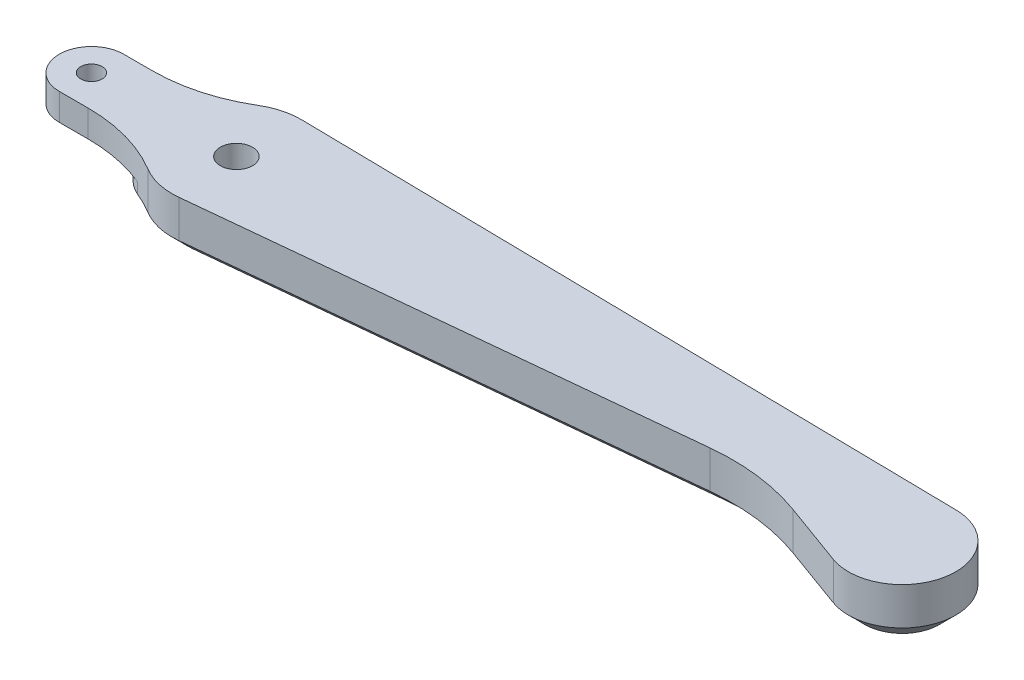
ISO-10303-21;
HEADER;
FILE_DESCRIPTION(('STEP AP214'),'2;1');
FILE_NAME('part.step','',(''),(''),'','','');
FILE_SCHEMA(('AUTOMOTIVE_DESIGN { 1 0 10303 214 1 1 1 1 }'));
ENDSEC;
DATA;
#1=APPLICATION_CONTEXT('core data for automotive mechanical design processes');
#2=APPLICATION_PROTOCOL_DEFINITION('international standard','automotive_design',2000,#1);
#3=PRODUCT_CONTEXT('',#1,'mechanical');
#4=PRODUCT('Part','Part','',(#3));
#5=PRODUCT_RELATED_PRODUCT_CATEGORY('part','',(#4));
#6=PRODUCT_DEFINITION_FORMATION('','',#4);
#7=PRODUCT_DEFINITION_CONTEXT('part definition',#1,'design');
#8=PRODUCT_DEFINITION('design','',#6,#7);
#9=PRODUCT_DEFINITION_SHAPE('','',#8);
#10=(LENGTH_UNIT() NAMED_UNIT(*) SI_UNIT(.MILLI.,.METRE.));
#11=(NAMED_UNIT(*) PLANE_ANGLE_UNIT() SI_UNIT($,.RADIAN.));
#12=(NAMED_UNIT(*) SI_UNIT($,.STERADIAN.) SOLID_ANGLE_UNIT());
#13=UNCERTAINTY_MEASURE_WITH_UNIT(LENGTH_MEASURE(1.E-05),#10,'distance_accuracy_value','');
#14=(GEOMETRIC_REPRESENTATION_CONTEXT(3) GLOBAL_UNCERTAINTY_ASSIGNED_CONTEXT((#13)) GLOBAL_UNIT_ASSIGNED_CONTEXT((#10,
#11,#12)) REPRESENTATION_CONTEXT('',''));
#15=CARTESIAN_POINT('',(0.,0.,0.));
#16=DIRECTION('',(0.,0.,1.));
#17=DIRECTION('',(1.,0.,0.));
#18=AXIS2_PLACEMENT_3D('',#15,#16,#17);
#19=CARTESIAN_POINT('',(-13.5,5.,0.));
#20=DIRECTION('',(0.,-1.,0.));
#21=DIRECTION('',(0.,0.,-1.));
#22=AXIS2_PLACEMENT_3D('',#19,#20,#21);
#23=CYLINDRICAL_SURFACE('',#22,3.);
#24=CARTESIAN_POINT('',(-13.5,2.5,0.));
#25=DIRECTION('',(0.,-1.,0.));
#26=DIRECTION('',(0.,0.,-1.));
#27=AXIS2_PLACEMENT_3D('',#24,#25,#26);
#28=CIRCLE('',#27,3.);
#29=CARTESIAN_POINT('',(-13.5,2.5,3.));
#30=VERTEX_POINT('',#29);
#31=CARTESIAN_POINT('',(-13.5,2.5,-3.));
#32=VERTEX_POINT('',#31);
#33=EDGE_CURVE('E193',#30,#32,#28,.T.);
#34=ORIENTED_EDGE('',*,*,#33,.F.);
#35=DIRECTION('',(0.,-1.,0.));
#36=VECTOR('',#35,1.);
#37=CARTESIAN_POINT('',(-13.5,5.,3.));
#38=LINE('',#37,#36);
#39=CARTESIAN_POINT('',(-13.5,5.,3.));
#40=VERTEX_POINT('',#39);
#41=EDGE_CURVE('E218',#40,#30,#38,.T.);
#42=ORIENTED_EDGE('',*,*,#41,.F.);
#43=CARTESIAN_POINT('',(-13.5,5.,0.));
#44=DIRECTION('',(0.,1.,0.));
#45=DIRECTION('',(0.,0.,1.));
#46=AXIS2_PLACEMENT_3D('',#43,#44,#45);
#47=CIRCLE('',#46,3.);
#48=CARTESIAN_POINT('',(-13.5,5.,-3.));
#49=VERTEX_POINT('',#48);
#50=EDGE_CURVE('E216',#49,#40,#47,.T.);
#51=ORIENTED_EDGE('',*,*,#50,.F.);
#52=DIRECTION('',(0.,-1.,0.));
#53=VECTOR('',#52,1.);
#54=CARTESIAN_POINT('',(-13.5,5.,-3.));
#55=LINE('',#54,#53);
#56=EDGE_CURVE('E210',#49,#32,#55,.T.);
#57=ORIENTED_EDGE('',*,*,#56,.T.);
#58=EDGE_LOOP('',(#34,#42,#51,#57));
#59=FACE_BOUND('',#58,.T.);
#60=ADVANCED_FACE('F41',(#59),#23,.T.);
#61=CARTESIAN_POINT('',(-13.5,5.,0.));
#62=DIRECTION('',(0.,-1.,0.));
#63=DIRECTION('',(0.,0.,-1.));
#64=AXIS2_PLACEMENT_3D('',#61,#62,#63);
#65=CYLINDRICAL_SURFACE('',#64,1.);
#66=CARTESIAN_POINT('',(-13.5,5.,0.));
#67=DIRECTION('',(0.,1.,0.));
#68=DIRECTION('',(0.,0.,1.));
#69=AXIS2_PLACEMENT_3D('',#66,#67,#68);
#70=CIRCLE('',#69,1.);
#71=CARTESIAN_POINT('',(-13.5,5.,1.));
#72=VERTEX_POINT('',#71);
#73=EDGE_CURVE('E245',#72,#72,#70,.T.);
#74=ORIENTED_EDGE('',*,*,#73,.T.);
#75=EDGE_LOOP('',(#74));
#76=FACE_BOUND('',#75,.T.);
#77=CARTESIAN_POINT('',(-13.5,2.5,0.));
#78=DIRECTION('',(0.,-1.,0.));
#79=DIRECTION('',(0.,0.,-1.));
#80=AXIS2_PLACEMENT_3D('',#77,#78,#79);
#81=CIRCLE('',#80,1.);
#82=CARTESIAN_POINT('',(-13.5,2.5,-0.999999999999998));
#83=VERTEX_POINT('',#82);
#84=EDGE_CURVE('E242',#83,#83,#81,.T.);
#85=ORIENTED_EDGE('',*,*,#84,.T.);
#86=EDGE_LOOP('',(#85));
#87=FACE_BOUND('',#86,.T.);
#88=ADVANCED_FACE('F499',(#76,#87),#65,.F.);
#89=CARTESIAN_POINT('',(0.,5.,0.));
#90=DIRECTION('',(0.,1.,0.));
#91=DIRECTION('',(0.,0.,1.));
#92=AXIS2_PLACEMENT_3D('',#89,#90,#91);
#93=PLANE('',#92);
#94=CARTESIAN_POINT('',(0.,5.,0.));
#95=DIRECTION('',(0.,1.,0.));
#96=DIRECTION('',(0.,0.,1.));
#97=AXIS2_PLACEMENT_3D('',#94,#95,#96);
#98=CIRCLE('',#97,1.5);
#99=CARTESIAN_POINT('',(0.,5.,1.5));
#100=VERTEX_POINT('',#99);
#101=EDGE_CURVE('E406',#100,#100,#98,.T.);
#102=ORIENTED_EDGE('',*,*,#101,.F.);
#103=EDGE_LOOP('',(#102));
#104=FACE_BOUND('',#103,.T.);
#105=DIRECTION('',(1.,0.,0.));
#106=VECTOR('',#105,1.);
#107=CARTESIAN_POINT('',(-13.5,5.,3.));
#108=LINE('',#107,#106);
#109=CARTESIAN_POINT('',(-10.816653826392,5.,3.));
#110=VERTEX_POINT('',#109);
#111=EDGE_CURVE('E223',#40,#110,#108,.T.);
#112=ORIENTED_EDGE('',*,*,#111,.T.);
#113=CARTESIAN_POINT('',(-10.816653826392,5.,18.));
#114=DIRECTION('',(0.,1.,0.));
#115=DIRECTION('',(0.,0.,1.));
#116=AXIS2_PLACEMENT_3D('',#113,#114,#115);
#117=CIRCLE('',#116,15.);
#118=CARTESIAN_POINT('',(-3.09047252182628,5.,5.14285714285715));
#119=VERTEX_POINT('',#118);
#120=EDGE_CURVE('E254',#110,#119,#117,.F.);
#121=ORIENTED_EDGE('',*,*,#120,.T.);
#122=CARTESIAN_POINT('',(0.,5.,0.));
#123=DIRECTION('',(0.,1.,0.));
#124=DIRECTION('',(0.,0.,1.));
#125=AXIS2_PLACEMENT_3D('',#122,#123,#124);
#126=CIRCLE('',#125,6.);
#127=CARTESIAN_POINT('',(0.6,5.,5.96992462263972));
#128=VERTEX_POINT('',#127);
#129=EDGE_CURVE('E382',#119,#128,#126,.T.);
#130=ORIENTED_EDGE('',*,*,#129,.T.);
#131=DIRECTION('',(0.99498743710662,0.,-0.1));
#132=VECTOR('',#131,1.);
#133=CARTESIAN_POINT('',(0.6,5.,5.96992462263972));
#134=LINE('',#133,#132);
#135=CARTESIAN_POINT('',(45.558314025328,5.,1.4514440520644));
#136=VERTEX_POINT('',#135);
#137=EDGE_CURVE('E377',#128,#136,#134,.T.);
#138=ORIENTED_EDGE('',*,*,#137,.T.);
#139=CARTESIAN_POINT('',(47.558314025328,5.,21.3511927941968));
#140=DIRECTION('',(0.,1.,0.));
#141=DIRECTION('',(0.,0.,1.));
#142=AXIS2_PLACEMENT_3D('',#139,#140,#141);
#143=CIRCLE('',#142,20.);
#144=CARTESIAN_POINT('',(54.3900117299452,5.,2.55417424143884));
#145=VERTEX_POINT('',#144);
#146=EDGE_CURVE('E239',#136,#145,#143,.F.);
#147=ORIENTED_EDGE('',*,*,#146,.T.);
#148=DIRECTION('',(0.939850927637898,0.,0.341584885230865));
#149=VECTOR('',#148,1.);
#150=CARTESIAN_POINT('',(50.1,5.,0.99498743710662));
#151=LINE('',#150,#149);
#152=CARTESIAN_POINT('',(60.2920755738457,5.,4.69925463818949));
#153=VERTEX_POINT('',#152);
#154=EDGE_CURVE('E373',#145,#153,#151,.T.);
#155=ORIENTED_EDGE('',*,*,#154,.T.);
#156=CARTESIAN_POINT('',(62.,5.,0.));
#157=DIRECTION('',(0.,1.,0.));
#158=DIRECTION('',(0.,0.,1.));
#159=AXIS2_PLACEMENT_3D('',#156,#157,#158);
#160=CIRCLE('',#159,5.);
#161=CARTESIAN_POINT('',(62.0806446767956,5.,-4.99934960130861));
#162=VERTEX_POINT('',#161);
#163=EDGE_CURVE('E376',#153,#162,#160,.T.);
#164=ORIENTED_EDGE('',*,*,#163,.T.);
#165=DIRECTION('',(-0.999869920261722,0.,-0.0161289353591094));
#166=VECTOR('',#165,1.);
#167=CARTESIAN_POINT('',(0.105263157894737,5.,-5.99907656790527));
#168=LINE('',#167,#166);
#169=CARTESIAN_POINT('',(0.105263157894737,5.,-5.99907656790527));
#170=VERTEX_POINT('',#169);
#171=EDGE_CURVE('E379',#162,#170,#168,.T.);
#172=ORIENTED_EDGE('',*,*,#171,.T.);
#173=CARTESIAN_POINT('',(0.,5.,0.));
#174=DIRECTION('',(0.,1.,0.));
#175=DIRECTION('',(0.,0.,1.));
#176=AXIS2_PLACEMENT_3D('',#173,#174,#175);
#177=CIRCLE('',#176,6.);
#178=CARTESIAN_POINT('',(-3.09047252182628,5.,-5.14285714285714));
#179=VERTEX_POINT('',#178);
#180=EDGE_CURVE('E387',#170,#179,#177,.T.);
#181=ORIENTED_EDGE('',*,*,#180,.T.);
#182=CARTESIAN_POINT('',(-10.816653826392,5.,-18.));
#183=DIRECTION('',(0.,1.,0.));
#184=DIRECTION('',(0.,0.,1.));
#185=AXIS2_PLACEMENT_3D('',#182,#183,#184);
#186=CIRCLE('',#185,15.);
#187=CARTESIAN_POINT('',(-10.816653826392,5.,-3.));
#188=VERTEX_POINT('',#187);
#189=EDGE_CURVE('E258',#179,#188,#186,.F.);
#190=ORIENTED_EDGE('',*,*,#189,.T.);
#191=DIRECTION('',(-1.,0.,0.));
#192=VECTOR('',#191,1.);
#193=CARTESIAN_POINT('',(-13.5,5.,-3.));
#194=LINE('',#193,#192);
#195=EDGE_CURVE('E390',#188,#49,#194,.T.);
#196=ORIENTED_EDGE('',*,*,#195,.T.);
#197=ORIENTED_EDGE('',*,*,#50,.T.);
#198=EDGE_LOOP('',(#112,#121,#130,#138,#147,#155,#164,#172,#181,#190,#196,#197));
#199=FACE_BOUND('',#198,.T.);
#200=ORIENTED_EDGE('',*,*,#73,.F.);
#201=EDGE_LOOP('',(#200));
#202=FACE_BOUND('',#201,.T.);
#203=ADVANCED_FACE('F395',(#104,#199,#202),#93,.T.);
#204=CARTESIAN_POINT('',(0.,0.,0.));
#205=DIRECTION('',(0.,1.,0.));
#206=DIRECTION('',(0.,0.,1.));
#207=AXIS2_PLACEMENT_3D('',#204,#205,#206);
#208=PLANE('',#207);
#209=CARTESIAN_POINT('',(-3.5,0.,-0.465275115225112));
#210=DIRECTION('',(0.,1.,0.));
#211=DIRECTION('',(0.,0.,1.));
#212=AXIS2_PLACEMENT_3D('',#209,#210,#211);
#213=CIRCLE('',#212,2.49999999999998);
#214=CARTESIAN_POINT('',(-5.99999999999998,0.,-0.465275115225112));
#215=VERTEX_POINT('',#214);
#216=CARTESIAN_POINT('',(-4.46271760873577,0.,-2.77247575795863));
#217=VERTEX_POINT('',#216);
#218=EDGE_CURVE('E295',#215,#217,#213,.F.);
#219=ORIENTED_EDGE('',*,*,#218,.T.);
#220=CARTESIAN_POINT('',(-10.816653826392,0.,-18.));
#221=DIRECTION('',(0.,1.,0.));
#222=DIRECTION('',(0.,0.,1.));
#223=AXIS2_PLACEMENT_3D('',#220,#221,#222);
#224=CIRCLE('',#223,16.5);
#225=CARTESIAN_POINT('',(-2.3178543913697,0.,-3.85714285714284));
#226=VERTEX_POINT('',#225);
#227=EDGE_CURVE('E297',#217,#226,#224,.T.);
#228=ORIENTED_EDGE('',*,*,#227,.T.);
#229=CARTESIAN_POINT('',(0.,0.,0.));
#230=DIRECTION('',(0.,1.,0.));
#231=DIRECTION('',(0.,0.,1.));
#232=AXIS2_PLACEMENT_3D('',#229,#230,#231);
#233=CIRCLE('',#232,4.49999999999998);
#234=CARTESIAN_POINT('',(0.0789473441964589,0.,-4.49930592419049));
#235=VERTEX_POINT('',#234);
#236=EDGE_CURVE('E293',#226,#235,#233,.F.);
#237=ORIENTED_EDGE('',*,*,#236,.T.);
#238=DIRECTION('',(0.999869920261722,0.,0.0161289353591094));
#239=VECTOR('',#238,1.);
#240=CARTESIAN_POINT('',(0.072580112217619,0.,-4.49940863422399));
#241=LINE('',#240,#239);
#242=CARTESIAN_POINT('',(62.0564512737569,0.,-3.499544720916));
#243=VERTEX_POINT('',#242);
#244=EDGE_CURVE('E289',#235,#243,#241,.T.);
#245=ORIENTED_EDGE('',*,*,#244,.T.);
#246=CARTESIAN_POINT('',(62.,0.,0.));
#247=DIRECTION('',(0.,1.,0.));
#248=DIRECTION('',(0.,0.,1.));
#249=AXIS2_PLACEMENT_3D('',#246,#247,#248);
#250=CIRCLE('',#249,3.49999999999998);
#251=CARTESIAN_POINT('',(60.804452901692,0.,3.28947824673261));
#252=VERTEX_POINT('',#251);
#253=EDGE_CURVE('E285',#243,#252,#250,.F.);
#254=ORIENTED_EDGE('',*,*,#253,.T.);
#255=DIRECTION('',(-0.939850927637898,0.,-0.341584885230865));
#256=VECTOR('',#255,1.);
#257=CARTESIAN_POINT('',(6.03862739841933,0.,-16.6149317708488));
#258=LINE('',#257,#256);
#259=CARTESIAN_POINT('',(54.9023890577916,0.,1.14439784998197));
#260=VERTEX_POINT('',#259);
#261=EDGE_CURVE('E281',#252,#260,#258,.T.);
#262=ORIENTED_EDGE('',*,*,#261,.T.);
#263=CARTESIAN_POINT('',(47.558314025328,0.,21.3511927941968));
#264=DIRECTION('',(0.,1.,0.));
#265=DIRECTION('',(0.,0.,1.));
#266=AXIS2_PLACEMENT_3D('',#263,#264,#265);
#267=CIRCLE('',#266,21.5);
#268=CARTESIAN_POINT('',(45.4083140253279,0.,-0.0410371035955528));
#269=VERTEX_POINT('',#268);
#270=EDGE_CURVE('E277',#260,#269,#267,.T.);
#271=ORIENTED_EDGE('',*,*,#270,.T.);
#272=DIRECTION('',(-0.99498743710662,0.,0.1));
#273=VECTOR('',#272,1.);
#274=CARTESIAN_POINT('',(0.449999999999998,0.,4.47744346697977));
#275=LINE('',#274,#273);
#276=CARTESIAN_POINT('',(0.449999999999997,0.,4.47744346697977));
#277=VERTEX_POINT('',#276);
#278=EDGE_CURVE('E275',#269,#277,#275,.T.);
#279=ORIENTED_EDGE('',*,*,#278,.T.);
#280=CARTESIAN_POINT('',(0.,0.,0.));
#281=DIRECTION('',(0.,1.,0.));
#282=DIRECTION('',(0.,0.,1.));
#283=AXIS2_PLACEMENT_3D('',#280,#281,#282);
#284=CIRCLE('',#283,4.49999999999998);
#285=CARTESIAN_POINT('',(-2.3178543913697,0.,3.85714285714284));
#286=VERTEX_POINT('',#285);
#287=EDGE_CURVE('E279',#277,#286,#284,.F.);
#288=ORIENTED_EDGE('',*,*,#287,.T.);
#289=CARTESIAN_POINT('',(-10.816653826392,0.,18.));
#290=DIRECTION('',(0.,1.,0.));
#291=DIRECTION('',(0.,0.,1.));
#292=AXIS2_PLACEMENT_3D('',#289,#290,#291);
#293=CIRCLE('',#292,16.5);
#294=CARTESIAN_POINT('',(-4.46271760873577,0.,2.77247575795863));
#295=VERTEX_POINT('',#294);
#296=EDGE_CURVE('E283',#286,#295,#293,.T.);
#297=ORIENTED_EDGE('',*,*,#296,.T.);
#298=CARTESIAN_POINT('',(-3.5,0.,0.465275115225112));
#299=DIRECTION('',(0.,1.,0.));
#300=DIRECTION('',(0.,0.,1.));
#301=AXIS2_PLACEMENT_3D('',#298,#299,#300);
#302=CIRCLE('',#301,2.49999999999998);
#303=CARTESIAN_POINT('',(-5.99999999999998,0.,0.465275115225112));
#304=VERTEX_POINT('',#303);
#305=EDGE_CURVE('E287',#295,#304,#302,.F.);
#306=ORIENTED_EDGE('',*,*,#305,.T.);
#307=DIRECTION('',(0.,0.,-1.));
#308=VECTOR('',#307,1.);
#309=CARTESIAN_POINT('',(-5.99999999999998,0.,0.));
#310=LINE('',#309,#308);
#311=EDGE_CURVE('E291',#304,#215,#310,.T.);
#312=ORIENTED_EDGE('',*,*,#311,.T.);
#313=EDGE_LOOP('',(#219,#228,#237,#245,#254,#262,#271,#279,#288,#297,#306,#312));
#314=FACE_BOUND('',#313,.T.);
#315=CARTESIAN_POINT('',(0.,0.,0.));
#316=DIRECTION('',(0.,1.,0.));
#317=DIRECTION('',(0.,0.,1.));
#318=AXIS2_PLACEMENT_3D('',#315,#316,#317);
#319=CIRCLE('',#318,1.5);
#320=CARTESIAN_POINT('',(0.,0.,1.5));
#321=VERTEX_POINT('',#320);
#322=EDGE_CURVE('E408',#321,#321,#319,.T.);
#323=ORIENTED_EDGE('',*,*,#322,.T.);
#324=EDGE_LOOP('',(#323));
#325=FACE_BOUND('',#324,.T.);
#326=ADVANCED_FACE('F451',(#314,#325),#208,.F.);
#327=CARTESIAN_POINT('',(0.,5.,0.));
#328=DIRECTION('',(0.,-1.,0.));
#329=DIRECTION('',(0.,0.,-1.));
#330=AXIS2_PLACEMENT_3D('',#327,#328,#329);
#331=CYLINDRICAL_SURFACE('',#330,6.);
#332=DIRECTION('',(0.,-1.,0.));
#333=VECTOR('',#332,1.);
#334=CARTESIAN_POINT('',(-3.09047252182628,5.,5.14285714285715));
#335=LINE('',#334,#333);
#336=CARTESIAN_POINT('',(-3.09047252182628,1.50000000000002,5.14285714285715));
#337=VERTEX_POINT('',#336);
#338=EDGE_CURVE('E241',#119,#337,#335,.T.);
#339=ORIENTED_EDGE('',*,*,#338,.T.);
#340=CARTESIAN_POINT('',(0.,1.50000000000002,0.));
#341=DIRECTION('',(0.,1.,0.));
#342=DIRECTION('',(0.,0.,1.));
#343=AXIS2_PLACEMENT_3D('',#340,#341,#342);
#344=CIRCLE('',#343,6.);
#345=CARTESIAN_POINT('',(0.6,1.50000000000002,5.96992462263972));
#346=VERTEX_POINT('',#345);
#347=EDGE_CURVE('E65',#337,#346,#344,.T.);
#348=ORIENTED_EDGE('',*,*,#347,.T.);
#349=DIRECTION('',(0.,-1.,0.));
#350=VECTOR('',#349,1.);
#351=CARTESIAN_POINT('',(0.6,5.,5.96992462263972));
#352=LINE('',#351,#350);
#353=EDGE_CURVE('E232',#128,#346,#352,.T.);
#354=ORIENTED_EDGE('',*,*,#353,.F.);
#355=ORIENTED_EDGE('',*,*,#129,.F.);
#356=EDGE_LOOP('',(#339,#348,#354,#355));
#357=FACE_BOUND('',#356,.T.);
#358=ADVANCED_FACE('F404',(#357),#331,.T.);
#359=CARTESIAN_POINT('',(0.6,5.,5.96992462263972));
#360=DIRECTION('',(-0.1,0.,-0.99498743710662));
#361=DIRECTION('',(-0.99498743710662,0.,0.1));
#362=AXIS2_PLACEMENT_3D('',#359,#360,#361);
#363=PLANE('',#362);
#364=ORIENTED_EDGE('',*,*,#353,.T.);
#365=DIRECTION('',(0.99498743710662,0.,-0.1));
#366=VECTOR('',#365,1.);
#367=CARTESIAN_POINT('',(0.6,1.50000000000002,5.96992462263972));
#368=LINE('',#367,#366);
#369=CARTESIAN_POINT('',(45.558314025328,1.50000000000002,1.4514440520644));
#370=VERTEX_POINT('',#369);
#371=EDGE_CURVE('E11',#346,#370,#368,.T.);
#372=ORIENTED_EDGE('',*,*,#371,.T.);
#373=DIRECTION('',(0.,-1.,0.));
#374=VECTOR('',#373,1.);
#375=CARTESIAN_POINT('',(45.558314025328,5.,1.4514440520644));
#376=LINE('',#375,#374);
#377=EDGE_CURVE('E237',#370,#136,#376,.F.);
#378=ORIENTED_EDGE('',*,*,#377,.T.);
#379=ORIENTED_EDGE('',*,*,#137,.F.);
#380=EDGE_LOOP('',(#364,#372,#378,#379));
#381=FACE_BOUND('',#380,.T.);
#382=ADVANCED_FACE('F520',(#381),#363,.F.);
#383=CARTESIAN_POINT('',(50.1,5.,0.99498743710662));
#384=DIRECTION('',(0.341584885230865,0.,-0.939850927637898));
#385=DIRECTION('',(-0.939850927637898,0.,-0.341584885230865));
#386=AXIS2_PLACEMENT_3D('',#383,#384,#385);
#387=PLANE('',#386);
#388=DIRECTION('',(0.,-1.,0.));
#389=VECTOR('',#388,1.);
#390=CARTESIAN_POINT('',(54.3900117299452,0.,2.55417424143884));
#391=LINE('',#390,#389);
#392=CARTESIAN_POINT('',(54.3900117299452,1.50000000000002,2.55417424143884));
#393=VERTEX_POINT('',#392);
#394=EDGE_CURVE('E234',#145,#393,#391,.T.);
#395=ORIENTED_EDGE('',*,*,#394,.T.);
#396=DIRECTION('',(0.939850927637898,0.,0.341584885230865));
#397=VECTOR('',#396,1.);
#398=CARTESIAN_POINT('',(50.1,1.50000000000002,0.99498743710662));
#399=LINE('',#398,#397);
#400=CARTESIAN_POINT('',(60.2920755738457,1.50000000000002,4.69925463818949));
#401=VERTEX_POINT('',#400);
#402=EDGE_CURVE('E317',#393,#401,#399,.T.);
#403=ORIENTED_EDGE('',*,*,#402,.T.);
#404=DIRECTION('',(0.,-1.,0.));
#405=VECTOR('',#404,1.);
#406=CARTESIAN_POINT('',(60.2920755738457,5.,4.69925463818949));
#407=LINE('',#406,#405);
#408=EDGE_CURVE('E229',#153,#401,#407,.T.);
#409=ORIENTED_EDGE('',*,*,#408,.F.);
#410=ORIENTED_EDGE('',*,*,#154,.F.);
#411=EDGE_LOOP('',(#395,#403,#409,#410));
#412=FACE_BOUND('',#411,.T.);
#413=ADVANCED_FACE('F371',(#412),#387,.F.);
#414=CARTESIAN_POINT('',(62.,5.,0.));
#415=DIRECTION('',(0.,-1.,0.));
#416=DIRECTION('',(0.,0.,-1.));
#417=AXIS2_PLACEMENT_3D('',#414,#415,#416);
#418=CYLINDRICAL_SURFACE('',#417,5.);
#419=ORIENTED_EDGE('',*,*,#408,.T.);
#420=CARTESIAN_POINT('',(62.,1.50000000000002,0.));
#421=DIRECTION('',(0.,1.,0.));
#422=DIRECTION('',(0.,0.,1.));
#423=AXIS2_PLACEMENT_3D('',#420,#421,#422);
#424=CIRCLE('',#423,5.);
#425=CARTESIAN_POINT('',(62.0806446767956,1.50000000000002,-4.99934960130861));
#426=VERTEX_POINT('',#425);
#427=EDGE_CURVE('E313',#401,#426,#424,.T.);
#428=ORIENTED_EDGE('',*,*,#427,.T.);
#429=DIRECTION('',(0.,-1.,0.));
#430=VECTOR('',#429,1.);
#431=CARTESIAN_POINT('',(62.0806446767956,5.,-4.99934960130861));
#432=LINE('',#431,#430);
#433=EDGE_CURVE('E221',#162,#426,#432,.T.);
#434=ORIENTED_EDGE('',*,*,#433,.F.);
#435=ORIENTED_EDGE('',*,*,#163,.F.);
#436=EDGE_LOOP('',(#419,#428,#434,#435));
#437=FACE_BOUND('',#436,.T.);
#438=ADVANCED_FACE('F479',(#437),#418,.T.);
#439=CARTESIAN_POINT('',(0.105263157894737,5.,-5.99907656790527));
#440=DIRECTION('',(-0.0161289353591094,0.,0.999869920261722));
#441=DIRECTION('',(0.999869920261722,0.,0.0161289353591094));
#442=AXIS2_PLACEMENT_3D('',#439,#440,#441);
#443=PLANE('',#442);
#444=ORIENTED_EDGE('',*,*,#433,.T.);
#445=DIRECTION('',(-0.999869920261722,0.,-0.0161289353591094));
#446=VECTOR('',#445,1.);
#447=CARTESIAN_POINT('',(0.105263157894737,1.50000000000002,-5.99907656790527));
#448=LINE('',#447,#446);
#449=CARTESIAN_POINT('',(0.105263157894737,1.50000000000002,-5.99907656790527));
#450=VERTEX_POINT('',#449);
#451=EDGE_CURVE('E309',#426,#450,#448,.T.);
#452=ORIENTED_EDGE('',*,*,#451,.T.);
#453=DIRECTION('',(0.,-1.,0.));
#454=VECTOR('',#453,1.);
#455=CARTESIAN_POINT('',(0.105263157894737,5.,-5.99907656790527));
#456=LINE('',#455,#454);
#457=EDGE_CURVE('E217',#170,#450,#456,.T.);
#458=ORIENTED_EDGE('',*,*,#457,.F.);
#459=ORIENTED_EDGE('',*,*,#171,.F.);
#460=EDGE_LOOP('',(#444,#452,#458,#459));
#461=FACE_BOUND('',#460,.T.);
#462=ADVANCED_FACE('F482',(#461),#443,.F.);
#463=CARTESIAN_POINT('',(0.,5.,0.));
#464=DIRECTION('',(0.,-1.,0.));
#465=DIRECTION('',(0.,0.,-1.));
#466=AXIS2_PLACEMENT_3D('',#463,#464,#465);
#467=CYLINDRICAL_SURFACE('',#466,6.);
#468=ORIENTED_EDGE('',*,*,#457,.T.);
#469=CARTESIAN_POINT('',(0.,1.50000000000002,0.));
#470=DIRECTION('',(0.,1.,0.));
#471=DIRECTION('',(0.,0.,1.));
#472=AXIS2_PLACEMENT_3D('',#469,#470,#471);
#473=CIRCLE('',#472,6.);
#474=CARTESIAN_POINT('',(-3.09047252182628,1.50000000000002,-5.14285714285714));
#475=VERTEX_POINT('',#474);
#476=EDGE_CURVE('E305',#450,#475,#473,.T.);
#477=ORIENTED_EDGE('',*,*,#476,.T.);
#478=DIRECTION('',(0.,-1.,0.));
#479=VECTOR('',#478,1.);
#480=CARTESIAN_POINT('',(-3.09047252182628,5.,-5.14285714285714));
#481=LINE('',#480,#479);
#482=EDGE_CURVE('E250',#475,#179,#481,.F.);
#483=ORIENTED_EDGE('',*,*,#482,.T.);
#484=ORIENTED_EDGE('',*,*,#180,.F.);
#485=EDGE_LOOP('',(#468,#477,#483,#484));
#486=FACE_BOUND('',#485,.T.);
#487=ADVANCED_FACE('F486',(#486),#467,.T.);
#488=CARTESIAN_POINT('',(-13.5,5.,-3.));
#489=DIRECTION('',(0.,0.,1.));
#490=DIRECTION('',(1.,0.,0.));
#491=AXIS2_PLACEMENT_3D('',#488,#489,#490);
#492=PLANE('',#491);
#493=ORIENTED_EDGE('',*,*,#195,.F.);
#494=DIRECTION('',(0.,1.,0.));
#495=VECTOR('',#494,1.);
#496=CARTESIAN_POINT('',(-10.816653826392,0.,-3.));
#497=LINE('',#496,#495);
#498=CARTESIAN_POINT('',(-10.816653826392,2.5,-3.));
#499=VERTEX_POINT('',#498);
#500=EDGE_CURVE('E213',#188,#499,#497,.F.);
#501=ORIENTED_EDGE('',*,*,#500,.T.);
#502=DIRECTION('',(1.,0.,0.));
#503=VECTOR('',#502,1.);
#504=CARTESIAN_POINT('',(-13.5,2.5,-3.));
#505=LINE('',#504,#503);
#506=EDGE_CURVE('E197',#32,#499,#505,.T.);
#507=ORIENTED_EDGE('',*,*,#506,.F.);
#508=ORIENTED_EDGE('',*,*,#56,.F.);
#509=EDGE_LOOP('',(#493,#501,#507,#508));
#510=FACE_BOUND('',#509,.T.);
#511=ADVANCED_FACE('F209',(#510),#492,.F.);
#512=CARTESIAN_POINT('',(-13.5,5.,3.));
#513=DIRECTION('',(0.,0.,-1.));
#514=DIRECTION('',(-1.,0.,0.));
#515=AXIS2_PLACEMENT_3D('',#512,#513,#514);
#516=PLANE('',#515);
#517=DIRECTION('',(-1.,0.,0.));
#518=VECTOR('',#517,1.);
#519=CARTESIAN_POINT('',(-13.5,2.5,3.));
#520=LINE('',#519,#518);
#521=CARTESIAN_POINT('',(-10.816653826392,2.5,3.));
#522=VERTEX_POINT('',#521);
#523=EDGE_CURVE('E199',#522,#30,#520,.T.);
#524=ORIENTED_EDGE('',*,*,#523,.F.);
#525=DIRECTION('',(0.,1.,0.));
#526=VECTOR('',#525,1.);
#527=CARTESIAN_POINT('',(-10.816653826392,5.,3.));
#528=LINE('',#527,#526);
#529=EDGE_CURVE('E247',#522,#110,#528,.T.);
#530=ORIENTED_EDGE('',*,*,#529,.T.);
#531=ORIENTED_EDGE('',*,*,#111,.F.);
#532=ORIENTED_EDGE('',*,*,#41,.T.);
#533=EDGE_LOOP('',(#524,#530,#531,#532));
#534=FACE_BOUND('',#533,.T.);
#535=ADVANCED_FACE('F508',(#534),#516,.F.);
#536=CARTESIAN_POINT('',(0.,5.,0.));
#537=DIRECTION('',(0.,-1.,0.));
#538=DIRECTION('',(0.,0.,-1.));
#539=AXIS2_PLACEMENT_3D('',#536,#537,#538);
#540=CYLINDRICAL_SURFACE('',#539,1.5);
#541=ORIENTED_EDGE('',*,*,#101,.T.);
#542=EDGE_LOOP('',(#541));
#543=FACE_BOUND('',#542,.T.);
#544=ORIENTED_EDGE('',*,*,#322,.F.);
#545=EDGE_LOOP('',(#544));
#546=FACE_BOUND('',#545,.T.);
#547=ADVANCED_FACE('F527',(#543,#546),#540,.F.);
#548=CARTESIAN_POINT('',(47.558314025328,5.,21.3511927941968));
#549=DIRECTION('',(0.,1.,0.));
#550=DIRECTION('',(0.,0.,1.));
#551=AXIS2_PLACEMENT_3D('',#548,#549,#550);
#552=CYLINDRICAL_SURFACE('',#551,20.);
#553=ORIENTED_EDGE('',*,*,#377,.F.);
#554=CARTESIAN_POINT('',(47.558314025328,1.50000000000002,21.3511927941968));
#555=DIRECTION('',(0.,1.,0.));
#556=DIRECTION('',(0.,0.,1.));
#557=AXIS2_PLACEMENT_3D('',#554,#555,#556);
#558=CIRCLE('',#557,20.);
#559=EDGE_CURVE('E51',#370,#393,#558,.F.);
#560=ORIENTED_EDGE('',*,*,#559,.T.);
#561=ORIENTED_EDGE('',*,*,#394,.F.);
#562=ORIENTED_EDGE('',*,*,#146,.F.);
#563=EDGE_LOOP('',(#553,#560,#561,#562));
#564=FACE_BOUND('',#563,.T.);
#565=ADVANCED_FACE('F367',(#564),#552,.F.);
#566=CARTESIAN_POINT('',(-7.5,2.5,3.));
#567=DIRECTION('',(1.,0.,0.));
#568=DIRECTION('',(0.,0.,-1.));
#569=AXIS2_PLACEMENT_3D('',#566,#567,#568);
#570=PLANE('',#569);
#571=DIRECTION('',(0.,-1.,0.));
#572=VECTOR('',#571,1.);
#573=CARTESIAN_POINT('',(-7.5,2.5,-0.465275115225112));
#574=LINE('',#573,#572);
#575=CARTESIAN_POINT('',(-7.5,2.5,-0.465275115225112));
#576=VERTEX_POINT('',#575);
#577=CARTESIAN_POINT('',(-7.5,1.50000000000002,-0.465275115225112));
#578=VERTEX_POINT('',#577);
#579=EDGE_CURVE('E262',#576,#578,#574,.T.);
#580=ORIENTED_EDGE('',*,*,#579,.T.);
#581=DIRECTION('',(0.,0.,1.));
#582=VECTOR('',#581,1.);
#583=CARTESIAN_POINT('',(-7.5,1.50000000000002,3.));
#584=LINE('',#583,#582);
#585=CARTESIAN_POINT('',(-7.5,1.50000000000002,0.465275115225111));
#586=VERTEX_POINT('',#585);
#587=EDGE_CURVE('E307',#578,#586,#584,.T.);
#588=ORIENTED_EDGE('',*,*,#587,.T.);
#589=DIRECTION('',(0.,-1.,0.));
#590=VECTOR('',#589,1.);
#591=CARTESIAN_POINT('',(-7.5,2.5,0.465275115225111));
#592=LINE('',#591,#590);
#593=CARTESIAN_POINT('',(-7.5,2.5,0.465275115225111));
#594=VERTEX_POINT('',#593);
#595=EDGE_CURVE('E260',#586,#594,#592,.F.);
#596=ORIENTED_EDGE('',*,*,#595,.T.);
#597=DIRECTION('',(0.,0.,1.));
#598=VECTOR('',#597,1.);
#599=CARTESIAN_POINT('',(-7.5,2.5,3.));
#600=LINE('',#599,#598);
#601=EDGE_CURVE('E214',#576,#594,#600,.T.);
#602=ORIENTED_EDGE('',*,*,#601,.F.);
#603=EDGE_LOOP('',(#580,#588,#596,#602));
#604=FACE_BOUND('',#603,.T.);
#605=ADVANCED_FACE('F423',(#604),#570,.F.);
#606=CARTESIAN_POINT('',(-13.5,2.5,0.));
#607=DIRECTION('',(0.,-1.,0.));
#608=DIRECTION('',(0.,0.,-1.));
#609=AXIS2_PLACEMENT_3D('',#606,#607,#608);
#610=PLANE('',#609);
#611=ORIENTED_EDGE('',*,*,#84,.F.);
#612=EDGE_LOOP('',(#611));
#613=FACE_BOUND('',#612,.T.);
#614=ORIENTED_EDGE('',*,*,#33,.T.);
#615=ORIENTED_EDGE('',*,*,#506,.T.);
#616=CARTESIAN_POINT('',(-10.816653826392,2.5,-18.));
#617=DIRECTION('',(0.,-1.,0.));
#618=DIRECTION('',(0.,0.,-1.));
#619=AXIS2_PLACEMENT_3D('',#616,#617,#618);
#620=CIRCLE('',#619,15.);
#621=CARTESIAN_POINT('',(-5.04034817397726,2.5,-4.15679614359877));
#622=VERTEX_POINT('',#621);
#623=EDGE_CURVE('E256',#499,#622,#620,.F.);
#624=ORIENTED_EDGE('',*,*,#623,.T.);
#625=CARTESIAN_POINT('',(-3.5,2.5,-0.465275115225112));
#626=DIRECTION('',(0.,-1.,0.));
#627=DIRECTION('',(0.,0.,-1.));
#628=AXIS2_PLACEMENT_3D('',#625,#626,#627);
#629=CIRCLE('',#628,4.);
#630=EDGE_CURVE('E270',#622,#576,#629,.F.);
#631=ORIENTED_EDGE('',*,*,#630,.T.);
#632=ORIENTED_EDGE('',*,*,#601,.T.);
#633=CARTESIAN_POINT('',(-3.5,2.5,0.465275115225112));
#634=DIRECTION('',(0.,-1.,0.));
#635=DIRECTION('',(0.,0.,-1.));
#636=AXIS2_PLACEMENT_3D('',#633,#634,#635);
#637=CIRCLE('',#636,4.);
#638=CARTESIAN_POINT('',(-5.04034817397725,2.5,4.15679614359877));
#639=VERTEX_POINT('',#638);
#640=EDGE_CURVE('E272',#594,#639,#637,.F.);
#641=ORIENTED_EDGE('',*,*,#640,.T.);
#642=CARTESIAN_POINT('',(-10.816653826392,2.5,18.));
#643=DIRECTION('',(0.,-1.,0.));
#644=DIRECTION('',(0.,0.,-1.));
#645=AXIS2_PLACEMENT_3D('',#642,#643,#644);
#646=CIRCLE('',#645,15.);
#647=EDGE_CURVE('E252',#639,#522,#646,.F.);
#648=ORIENTED_EDGE('',*,*,#647,.T.);
#649=ORIENTED_EDGE('',*,*,#523,.T.);
#650=EDGE_LOOP('',(#614,#615,#624,#631,#632,#641,#648,#649));
#651=FACE_BOUND('',#650,.T.);
#652=ADVANCED_FACE('F195',(#613,#651),#610,.T.);
#653=CARTESIAN_POINT('',(-10.816653826392,5.,18.));
#654=DIRECTION('',(0.,-1.,0.));
#655=DIRECTION('',(0.,0.,-1.));
#656=AXIS2_PLACEMENT_3D('',#653,#654,#655);
#657=CYLINDRICAL_SURFACE('',#656,15.);
#658=DIRECTION('',(0.,-1.,0.));
#659=VECTOR('',#658,1.);
#660=CARTESIAN_POINT('',(-5.04034817397725,5.,4.15679614359877));
#661=LINE('',#660,#659);
#662=CARTESIAN_POINT('',(-5.04034817397725,1.50000000000002,4.15679614359877));
#663=VERTEX_POINT('',#662);
#664=EDGE_CURVE('E267',#639,#663,#661,.T.);
#665=ORIENTED_EDGE('',*,*,#664,.T.);
#666=CARTESIAN_POINT('',(-10.816653826392,1.50000000000002,18.));
#667=DIRECTION('',(0.,1.,0.));
#668=DIRECTION('',(0.,0.,1.));
#669=AXIS2_PLACEMENT_3D('',#666,#667,#668);
#670=CIRCLE('',#669,15.);
#671=EDGE_CURVE('E315',#663,#337,#670,.F.);
#672=ORIENTED_EDGE('',*,*,#671,.T.);
#673=ORIENTED_EDGE('',*,*,#338,.F.);
#674=ORIENTED_EDGE('',*,*,#120,.F.);
#675=ORIENTED_EDGE('',*,*,#529,.F.);
#676=ORIENTED_EDGE('',*,*,#647,.F.);
#677=EDGE_LOOP('',(#665,#672,#673,#674,#675,#676));
#678=FACE_BOUND('',#677,.T.);
#679=ADVANCED_FACE('F402',(#678),#657,.F.);
#680=CARTESIAN_POINT('',(-10.816653826392,5.,-18.));
#681=DIRECTION('',(0.,-1.,0.));
#682=DIRECTION('',(0.,0.,-1.));
#683=AXIS2_PLACEMENT_3D('',#680,#681,#682);
#684=CYLINDRICAL_SURFACE('',#683,15.);
#685=ORIENTED_EDGE('',*,*,#482,.F.);
#686=CARTESIAN_POINT('',(-10.816653826392,1.50000000000002,-18.));
#687=DIRECTION('',(0.,1.,0.));
#688=DIRECTION('',(0.,0.,1.));
#689=AXIS2_PLACEMENT_3D('',#686,#687,#688);
#690=CIRCLE('',#689,15.);
#691=CARTESIAN_POINT('',(-5.04034817397726,1.50000000000002,-4.15679614359877));
#692=VERTEX_POINT('',#691);
#693=EDGE_CURVE('E300',#475,#692,#690,.F.);
#694=ORIENTED_EDGE('',*,*,#693,.T.);
#695=DIRECTION('',(0.,-1.,0.));
#696=VECTOR('',#695,1.);
#697=CARTESIAN_POINT('',(-5.04034817397726,5.,-4.15679614359877));
#698=LINE('',#697,#696);
#699=EDGE_CURVE('E265',#692,#622,#698,.F.);
#700=ORIENTED_EDGE('',*,*,#699,.T.);
#701=ORIENTED_EDGE('',*,*,#623,.F.);
#702=ORIENTED_EDGE('',*,*,#500,.F.);
#703=ORIENTED_EDGE('',*,*,#189,.F.);
#704=EDGE_LOOP('',(#685,#694,#700,#701,#702,#703));
#705=FACE_BOUND('',#704,.T.);
#706=ADVANCED_FACE('F439',(#705),#684,.F.);
#707=CARTESIAN_POINT('',(-3.5,5.,-0.465275115225112));
#708=DIRECTION('',(0.,-1.,0.));
#709=DIRECTION('',(0.,0.,-1.));
#710=AXIS2_PLACEMENT_3D('',#707,#708,#709);
#711=CYLINDRICAL_SURFACE('',#710,4.);
#712=ORIENTED_EDGE('',*,*,#699,.F.);
#713=CARTESIAN_POINT('',(-3.5,1.50000000000002,-0.465275115225112));
#714=DIRECTION('',(0.,1.,0.));
#715=DIRECTION('',(0.,0.,1.));
#716=AXIS2_PLACEMENT_3D('',#713,#714,#715);
#717=CIRCLE('',#716,4.);
#718=EDGE_CURVE('E303',#692,#578,#717,.T.);
#719=ORIENTED_EDGE('',*,*,#718,.T.);
#720=ORIENTED_EDGE('',*,*,#579,.F.);
#721=ORIENTED_EDGE('',*,*,#630,.F.);
#722=EDGE_LOOP('',(#712,#719,#720,#721));
#723=FACE_BOUND('',#722,.T.);
#724=ADVANCED_FACE('F428',(#723),#711,.T.);
#725=CARTESIAN_POINT('',(-3.5,5.,0.465275115225112));
#726=DIRECTION('',(0.,-1.,0.));
#727=DIRECTION('',(0.,0.,-1.));
#728=AXIS2_PLACEMENT_3D('',#725,#726,#727);
#729=CYLINDRICAL_SURFACE('',#728,4.);
#730=ORIENTED_EDGE('',*,*,#595,.F.);
#731=CARTESIAN_POINT('',(-3.5,1.50000000000002,0.465275115225112));
#732=DIRECTION('',(0.,1.,0.));
#733=DIRECTION('',(0.,0.,1.));
#734=AXIS2_PLACEMENT_3D('',#731,#732,#733);
#735=CIRCLE('',#734,4.);
#736=EDGE_CURVE('E311',#586,#663,#735,.T.);
#737=ORIENTED_EDGE('',*,*,#736,.T.);
#738=ORIENTED_EDGE('',*,*,#664,.F.);
#739=ORIENTED_EDGE('',*,*,#640,.F.);
#740=EDGE_LOOP('',(#730,#737,#738,#739));
#741=FACE_BOUND('',#740,.T.);
#742=ADVANCED_FACE('F460',(#741),#729,.T.);
#743=CARTESIAN_POINT('',(0.6,1.50000000000002,5.96992462263972));
#744=DIRECTION('',(-0.0707106781186547,0.707106781186548,-0.703562363973514));
#745=DIRECTION('',(0.99498743710662,0.,-0.1));
#746=AXIS2_PLACEMENT_3D('',#743,#744,#745);
#747=PLANE('',#746);
#748=DIRECTION('',(-0.0707106781186557,-0.707106781186547,-0.703562363973515));
#749=VECTOR('',#748,1.);
#750=CARTESIAN_POINT('',(45.558314025328,1.50000000000002,1.4514440520644));
#751=LINE('',#750,#749);
#752=EDGE_CURVE('E348',#370,#269,#751,.T.);
#753=ORIENTED_EDGE('',*,*,#752,.F.);
#754=ORIENTED_EDGE('',*,*,#371,.F.);
#755=DIRECTION('',(0.0707106781186547,0.707106781186547,0.703562363973515));
#756=VECTOR('',#755,1.);
#757=CARTESIAN_POINT('',(0.449999999999997,0.,4.47744346697977));
#758=LINE('',#757,#756);
#759=EDGE_CURVE('E46',#277,#346,#758,.T.);
#760=ORIENTED_EDGE('',*,*,#759,.F.);
#761=ORIENTED_EDGE('',*,*,#278,.F.);
#762=EDGE_LOOP('',(#753,#754,#760,#761));
#763=FACE_BOUND('',#762,.T.);
#764=ADVANCED_FACE('F44',(#763),#747,.F.);
#765=CARTESIAN_POINT('',(0.,1.50000000000002,0.));
#766=DIRECTION('',(0.,1.,0.));
#767=DIRECTION('',(0.,0.,1.));
#768=AXIS2_PLACEMENT_3D('',#765,#766,#767);
#769=CONICAL_SURFACE('',#768,6.,0.785398163397449);
#770=ORIENTED_EDGE('',*,*,#759,.T.);
#771=ORIENTED_EDGE('',*,*,#347,.F.);
#772=DIRECTION('',(-0.364215679542342,0.707106781186547,0.606091526731327));
#773=VECTOR('',#772,1.);
#774=CARTESIAN_POINT('',(-2.3178543913697,0.,3.85714285714284));
#775=LINE('',#774,#773);
#776=EDGE_CURVE('E346',#286,#337,#775,.T.);
#777=ORIENTED_EDGE('',*,*,#776,.F.);
#778=ORIENTED_EDGE('',*,*,#287,.F.);
#779=EDGE_LOOP('',(#770,#771,#777,#778));
#780=FACE_BOUND('',#779,.T.);
#781=ADVANCED_FACE('F358',(#780),#769,.T.);
#782=CARTESIAN_POINT('',(47.558314025328,0.,21.3511927941968));
#783=DIRECTION('',(0.,-1.,0.));
#784=DIRECTION('',(0.,0.,-1.));
#785=AXIS2_PLACEMENT_3D('',#782,#783,#784);
#786=CONICAL_SURFACE('',#785,21.5,0.785398163397448);
#787=ORIENTED_EDGE('',*,*,#752,.T.);
#788=ORIENTED_EDGE('',*,*,#270,.F.);
#789=DIRECTION('',(0.241536988697574,-0.707106781186547,-0.664574964237225));
#790=VECTOR('',#789,1.);
#791=CARTESIAN_POINT('',(54.3900117299452,1.50000000000002,2.55417424143884));
#792=LINE('',#791,#790);
#793=EDGE_CURVE('E343',#393,#260,#792,.T.);
#794=ORIENTED_EDGE('',*,*,#793,.F.);
#795=ORIENTED_EDGE('',*,*,#559,.F.);
#796=EDGE_LOOP('',(#787,#788,#794,#795));
#797=FACE_BOUND('',#796,.T.);
#798=ADVANCED_FACE('F363',(#797),#786,.F.);
#799=CARTESIAN_POINT('',(-10.816653826392,0.,18.));
#800=DIRECTION('',(0.,-1.,0.));
#801=DIRECTION('',(0.,0.,-1.));
#802=AXIS2_PLACEMENT_3D('',#799,#800,#801);
#803=CONICAL_SURFACE('',#802,16.5,0.78539816339745);
#804=ORIENTED_EDGE('',*,*,#776,.T.);
#805=ORIENTED_EDGE('',*,*,#671,.F.);
#806=DIRECTION('',(-0.272297659801909,0.707106781186547,0.652574888013939));
#807=VECTOR('',#806,1.);
#808=CARTESIAN_POINT('',(-4.46271760873577,0.,2.77247575795863));
#809=LINE('',#808,#807);
#810=EDGE_CURVE('E340',#295,#663,#809,.T.);
#811=ORIENTED_EDGE('',*,*,#810,.F.);
#812=ORIENTED_EDGE('',*,*,#296,.F.);
#813=EDGE_LOOP('',(#804,#805,#811,#812));
#814=FACE_BOUND('',#813,.T.);
#815=ADVANCED_FACE('F466',(#814),#803,.F.);
#816=CARTESIAN_POINT('',(50.1,1.50000000000002,0.99498743710662));
#817=DIRECTION('',(0.241536988697572,0.70710678118655,-0.664574964237223));
#818=DIRECTION('',(0.939850927637898,0.,0.341584885230865));
#819=AXIS2_PLACEMENT_3D('',#816,#817,#818);
#820=PLANE('',#819);
#821=ORIENTED_EDGE('',*,*,#793,.T.);
#822=ORIENTED_EDGE('',*,*,#261,.F.);
#823=DIRECTION('',(0.241536988697573,-0.707106781186546,-0.664574964237226));
#824=VECTOR('',#823,1.);
#825=CARTESIAN_POINT('',(60.2920755738457,1.50000000000002,4.69925463818949));
#826=LINE('',#825,#824);
#827=EDGE_CURVE('E337',#401,#252,#826,.T.);
#828=ORIENTED_EDGE('',*,*,#827,.F.);
#829=ORIENTED_EDGE('',*,*,#402,.F.);
#830=EDGE_LOOP('',(#821,#822,#828,#829));
#831=FACE_BOUND('',#830,.T.);
#832=ADVANCED_FACE('F469',(#831),#820,.F.);
#833=CARTESIAN_POINT('',(-3.5,0.,0.465275115225112));
#834=DIRECTION('',(0.,1.,0.));
#835=DIRECTION('',(0.,0.,1.));
#836=AXIS2_PLACEMENT_3D('',#833,#834,#835);
#837=CONICAL_SURFACE('',#836,2.49999999999998,0.785398163397449);
#838=ORIENTED_EDGE('',*,*,#810,.T.);
#839=ORIENTED_EDGE('',*,*,#736,.F.);
#840=DIRECTION('',(-0.707106781186548,0.707106781186547,0.));
#841=VECTOR('',#840,1.);
#842=CARTESIAN_POINT('',(-5.99999999999998,0.,0.465275115225112));
#843=LINE('',#842,#841);
#844=EDGE_CURVE('E334',#304,#586,#843,.T.);
#845=ORIENTED_EDGE('',*,*,#844,.F.);
#846=ORIENTED_EDGE('',*,*,#305,.F.);
#847=EDGE_LOOP('',(#838,#839,#845,#846));
#848=FACE_BOUND('',#847,.T.);
#849=ADVANCED_FACE('F462',(#848),#837,.T.);
#850=CARTESIAN_POINT('',(62.,1.50000000000002,0.));
#851=DIRECTION('',(0.,1.,0.));
#852=DIRECTION('',(0.,0.,1.));
#853=AXIS2_PLACEMENT_3D('',#850,#851,#852);
#854=CONICAL_SURFACE('',#853,5.,0.785398163397449);
#855=ORIENTED_EDGE('',*,*,#827,.T.);
#856=ORIENTED_EDGE('',*,*,#253,.F.);
#857=DIRECTION('',(-0.0114048795657454,-0.707106781186547,0.707014800921516));
#858=VECTOR('',#857,1.);
#859=CARTESIAN_POINT('',(62.0806446767956,1.50000000000002,-4.99934960130861));
#860=LINE('',#859,#858);
#861=EDGE_CURVE('E331',#426,#243,#860,.T.);
#862=ORIENTED_EDGE('',*,*,#861,.F.);
#863=ORIENTED_EDGE('',*,*,#427,.F.);
#864=EDGE_LOOP('',(#855,#856,#862,#863));
#865=FACE_BOUND('',#864,.T.);
#866=ADVANCED_FACE('F475',(#865),#854,.T.);
#867=CARTESIAN_POINT('',(-7.5,1.50000000000002,3.));
#868=DIRECTION('',(0.707106781186547,0.707106781186548,0.));
#869=DIRECTION('',(0.,0.,1.));
#870=AXIS2_PLACEMENT_3D('',#867,#868,#869);
#871=PLANE('',#870);
#872=ORIENTED_EDGE('',*,*,#844,.T.);
#873=ORIENTED_EDGE('',*,*,#587,.F.);
#874=DIRECTION('',(-0.707106781186548,0.707106781186547,0.));
#875=VECTOR('',#874,1.);
#876=CARTESIAN_POINT('',(-5.99999999999998,0.,-0.465275115225112));
#877=LINE('',#876,#875);
#878=EDGE_CURVE('E328',#215,#578,#877,.T.);
#879=ORIENTED_EDGE('',*,*,#878,.F.);
#880=ORIENTED_EDGE('',*,*,#311,.F.);
#881=EDGE_LOOP('',(#872,#873,#879,#880));
#882=FACE_BOUND('',#881,.T.);
#883=ADVANCED_FACE('F457',(#882),#871,.F.);
#884=CARTESIAN_POINT('',(0.105263157894737,1.50000000000002,-5.99907656790527));
#885=DIRECTION('',(-0.0114048795657457,0.707106781186548,0.707014800921515));
#886=DIRECTION('',(-0.999869920261722,0.,-0.0161289353591094));
#887=AXIS2_PLACEMENT_3D('',#884,#885,#886);
#888=PLANE('',#887);
#889=ORIENTED_EDGE('',*,*,#861,.T.);
#890=ORIENTED_EDGE('',*,*,#244,.F.);
#891=DIRECTION('',(-0.012405387334977,-0.707106427177797,0.706998307642189));
#892=VECTOR('',#891,1.);
#893=CARTESIAN_POINT('',(0.105263157894737,1.50000000000002,-5.99907656790527));
#894=LINE('',#893,#892);
#895=EDGE_CURVE('E325',#450,#235,#894,.T.);
#896=ORIENTED_EDGE('',*,*,#895,.F.);
#897=ORIENTED_EDGE('',*,*,#451,.F.);
#898=EDGE_LOOP('',(#889,#890,#896,#897));
#899=FACE_BOUND('',#898,.T.);
#900=ADVANCED_FACE('F488',(#899),#888,.F.);
#901=CARTESIAN_POINT('',(-3.5,0.,-0.465275115225112));
#902=DIRECTION('',(0.,1.,0.));
#903=DIRECTION('',(0.,0.,1.));
#904=AXIS2_PLACEMENT_3D('',#901,#902,#903);
#905=CONICAL_SURFACE('',#904,2.49999999999998,0.785398163397449);
#906=ORIENTED_EDGE('',*,*,#878,.T.);
#907=ORIENTED_EDGE('',*,*,#718,.F.);
#908=DIRECTION('',(-0.272297659801909,0.707106781186547,-0.652574888013939));
#909=VECTOR('',#908,1.);
#910=CARTESIAN_POINT('',(-4.46271760873577,0.,-2.77247575795863));
#911=LINE('',#910,#909);
#912=EDGE_CURVE('E323',#217,#692,#911,.T.);
#913=ORIENTED_EDGE('',*,*,#912,.F.);
#914=ORIENTED_EDGE('',*,*,#218,.F.);
#915=EDGE_LOOP('',(#906,#907,#913,#914));
#916=FACE_BOUND('',#915,.T.);
#917=ADVANCED_FACE('F432',(#916),#905,.T.);
#918=CARTESIAN_POINT('',(0.,1.50000000000002,0.));
#919=DIRECTION('',(0.,1.,0.));
#920=DIRECTION('',(0.,0.,1.));
#921=AXIS2_PLACEMENT_3D('',#918,#919,#920);
#922=CONICAL_SURFACE('',#921,6.,0.785398163397449);
#923=ORIENTED_EDGE('',*,*,#895,.T.);
#924=ORIENTED_EDGE('',*,*,#236,.F.);
#925=DIRECTION('',(0.364215679542342,-0.707106781186547,0.606091526731327));
#926=VECTOR('',#925,1.);
#927=CARTESIAN_POINT('',(-3.09047252182628,1.50000000000002,-5.14285714285714));
#928=LINE('',#927,#926);
#929=EDGE_CURVE('E321',#475,#226,#928,.T.);
#930=ORIENTED_EDGE('',*,*,#929,.F.);
#931=ORIENTED_EDGE('',*,*,#476,.F.);
#932=EDGE_LOOP('',(#923,#924,#930,#931));
#933=FACE_BOUND('',#932,.T.);
#934=ADVANCED_FACE('F447',(#933),#922,.T.);
#935=CARTESIAN_POINT('',(-10.816653826392,0.,-18.));
#936=DIRECTION('',(0.,-1.,0.));
#937=DIRECTION('',(0.,0.,-1.));
#938=AXIS2_PLACEMENT_3D('',#935,#936,#937);
#939=CONICAL_SURFACE('',#938,16.5,0.78539816339745);
#940=ORIENTED_EDGE('',*,*,#912,.T.);
#941=ORIENTED_EDGE('',*,*,#693,.F.);
#942=ORIENTED_EDGE('',*,*,#929,.T.);
#943=ORIENTED_EDGE('',*,*,#227,.F.);
#944=EDGE_LOOP('',(#940,#941,#942,#943));
#945=FACE_BOUND('',#944,.T.);
#946=ADVANCED_FACE('F443',(#945),#939,.F.);
#947=CLOSED_SHELL('',(#60,#88,#203,#326,#358,#382,#413,#438,#462,#487,#511,#535,#547,#565,#605,
#652,#679,#706,#724,#742,#764,#781,#798,#815,#832,#849,#866,#883,#900,#917,#934,#946));
#948=MANIFOLD_SOLID_BREP('B2',#947);
#949=ADVANCED_BREP_SHAPE_REPRESENTATION('',(#18,#948),#14);
#950=SHAPE_DEFINITION_REPRESENTATION(#9,#949);
ENDSEC;
END-ISO-10303-21;
